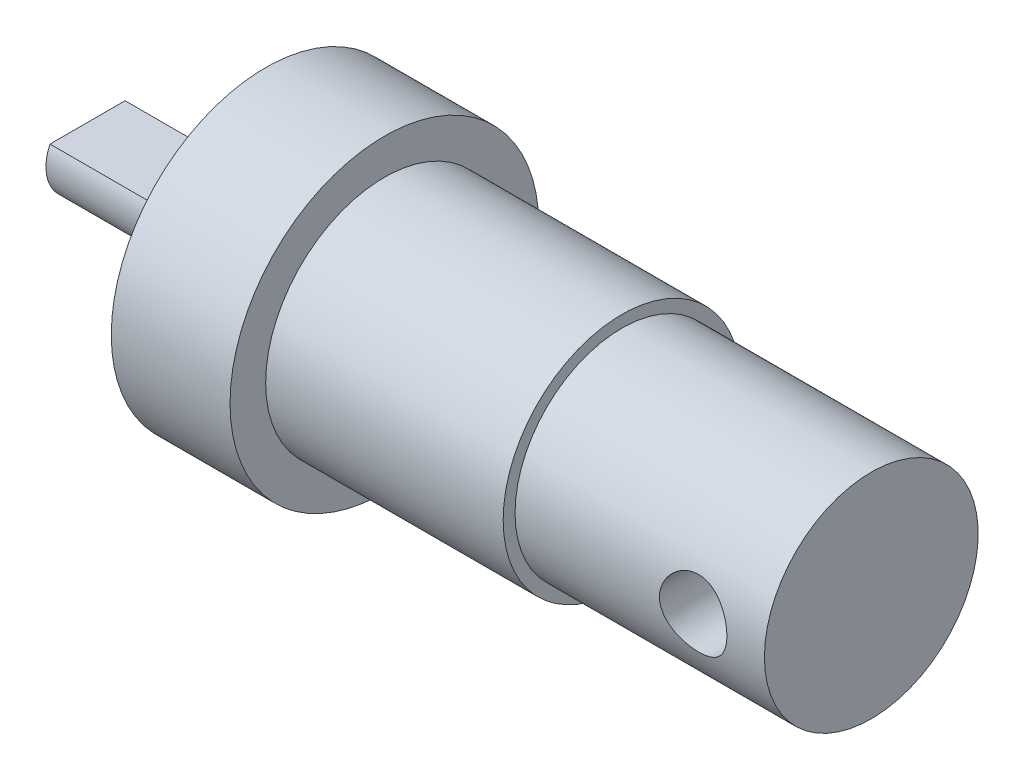
ISO-10303-21;
HEADER;
FILE_DESCRIPTION(('STEP AP214'),'2;1');
FILE_NAME('part.step','',(''),(''),'','','');
FILE_SCHEMA(('AUTOMOTIVE_DESIGN { 1 0 10303 214 1 1 1 1 }'));
ENDSEC;
DATA;
#1=APPLICATION_CONTEXT('core data for automotive mechanical design processes');
#2=APPLICATION_PROTOCOL_DEFINITION('international standard','automotive_design',2000,#1);
#3=PRODUCT_CONTEXT('',#1,'mechanical');
#4=PRODUCT('Part','Part','',(#3));
#5=PRODUCT_RELATED_PRODUCT_CATEGORY('part','',(#4));
#6=PRODUCT_DEFINITION_FORMATION('','',#4);
#7=PRODUCT_DEFINITION_CONTEXT('part definition',#1,'design');
#8=PRODUCT_DEFINITION('design','',#6,#7);
#9=PRODUCT_DEFINITION_SHAPE('','',#8);
#10=(LENGTH_UNIT() NAMED_UNIT(*) SI_UNIT(.MILLI.,.METRE.));
#11=(NAMED_UNIT(*) PLANE_ANGLE_UNIT() SI_UNIT($,.RADIAN.));
#12=(NAMED_UNIT(*) SI_UNIT($,.STERADIAN.) SOLID_ANGLE_UNIT());
#13=UNCERTAINTY_MEASURE_WITH_UNIT(LENGTH_MEASURE(1.E-05),#10,'distance_accuracy_value','');
#14=(GEOMETRIC_REPRESENTATION_CONTEXT(3) GLOBAL_UNCERTAINTY_ASSIGNED_CONTEXT((#13)) GLOBAL_UNIT_ASSIGNED_CONTEXT((#10,
#11,#12)) REPRESENTATION_CONTEXT('',''));
#15=CARTESIAN_POINT('',(0.,0.,0.));
#16=DIRECTION('',(0.,0.,1.));
#17=DIRECTION('',(1.,0.,0.));
#18=AXIS2_PLACEMENT_3D('',#15,#16,#17);
#19=CARTESIAN_POINT('',(-5.,0.,0.));
#20=DIRECTION('',(-1.,0.,0.));
#21=DIRECTION('',(0.,0.,1.));
#22=AXIS2_PLACEMENT_3D('',#19,#20,#21);
#23=CYLINDRICAL_SURFACE('',#22,4.5);
#24=CARTESIAN_POINT('',(16.588256828574,-1.09764286276754,4.36407838447224));
#25=CARTESIAN_POINT('',(16.5270833845499,-1.04617330759767,4.3770231438269));
#26=CARTESIAN_POINT('',(16.4702957225923,-0.989555024817385,4.39029354434856));
#27=CARTESIAN_POINT('',(16.3669482948807,-0.867467578833485,4.41603753323898));
#28=CARTESIAN_POINT('',(16.3203910086217,-0.801996276156327,4.42851092792226));
#29=CARTESIAN_POINT('',(16.2387721071905,-0.663768969664404,4.45132759737578));
#30=CARTESIAN_POINT('',(16.2037254457204,-0.591003648861528,4.46166809482042));
#31=CARTESIAN_POINT('',(16.1463734983666,-0.440249431524472,4.47905430840141));
#32=CARTESIAN_POINT('',(16.1240640621078,-0.362262245779606,4.48610109764383));
#33=CARTESIAN_POINT('',(16.0934520755528,-0.205622706533306,4.49596502276719));
#34=CARTESIAN_POINT('',(16.0847710562777,-0.127051613127193,4.49889619655373));
#35=CARTESIAN_POINT('',(16.08056352236,0.0304814895061291,4.50058568922495));
#36=CARTESIAN_POINT('',(16.0850348574784,0.109443432727423,4.49934469020088));
#37=CARTESIAN_POINT('',(16.106621519285,0.262909411636466,4.49294972792596));
#38=CARTESIAN_POINT('',(16.1233360822228,0.337475597910401,4.48791964963629));
#39=CARTESIAN_POINT('',(16.1683855120653,0.482700819526159,4.47463080465224));
#40=CARTESIAN_POINT('',(16.1967213843163,0.553359516235207,4.46637175862642));
#41=CARTESIAN_POINT('',(16.2647408305174,0.690176756413004,4.44730420264569));
#42=CARTESIAN_POINT('',(16.3046149506909,0.756234477154448,4.43645346687148));
#43=CARTESIAN_POINT('',(16.394395149402,0.880880079855516,4.41339714944489));
#44=CARTESIAN_POINT('',(16.4443038611503,0.939465994504709,4.4011912125469));
#45=CARTESIAN_POINT('',(16.5551388809534,1.0500078547806,4.37616597814393));
#46=CARTESIAN_POINT('',(16.6164312910696,1.10159632464824,4.36334195554905));
#47=CARTESIAN_POINT('',(16.7470058842268,1.19383246764867,4.33901442997745));
#48=CARTESIAN_POINT('',(16.8162884792733,1.234479576241,4.32751099515655));
#49=CARTESIAN_POINT('',(16.9613224490413,1.30374405651637,4.30715291598078));
#50=CARTESIAN_POINT('',(17.0370963466137,1.33231731944445,4.29830801730032));
#51=CARTESIAN_POINT('',(17.1927202408564,1.37620178670478,4.28446101595956));
#52=CARTESIAN_POINT('',(17.2725687020976,1.39151794823268,4.27945747698815));
#53=CARTESIAN_POINT('',(17.4303964139966,1.40793522697943,4.2740834338695));
#54=CARTESIAN_POINT('',(17.5083090176739,1.40961767642176,4.27352348052725));
#55=CARTESIAN_POINT('',(17.6632707119512,1.40023003273705,4.27660843959136));
#56=CARTESIAN_POINT('',(17.7403198817229,1.38916111865765,4.28025296323317));
#57=CARTESIAN_POINT('',(17.8897042210857,1.3550556783883,4.29116900724109));
#58=CARTESIAN_POINT('',(17.9621047143719,1.332277976861,4.29836195578642));
#59=CARTESIAN_POINT('',(18.1020808586957,1.27564264822176,4.31550767501424));
#60=CARTESIAN_POINT('',(18.1696555977164,1.24178293344075,4.32546096564581));
#61=CARTESIAN_POINT('',(18.3006113476724,1.16258163146239,4.34742970657724));
#62=CARTESIAN_POINT('',(18.3637667613169,1.11688372289622,4.35950452940484));
#63=CARTESIAN_POINT('',(18.4817081607143,1.01582716673405,4.38415284376729));
#64=CARTESIAN_POINT('',(18.5364921167669,0.960466183226663,4.39672645530803));
#65=CARTESIAN_POINT('',(18.6381589197758,0.839245617278976,4.42149568907948));
#66=CARTESIAN_POINT('',(18.6846828995163,0.773077955951485,4.43366103644533));
#67=CARTESIAN_POINT('',(18.7659336186728,0.633510958829209,4.45574319712107));
#68=CARTESIAN_POINT('',(18.8006617615522,0.560112484694877,4.46566027788202));
#69=CARTESIAN_POINT('',(18.856723172855,0.409325980989382,4.48197576080136));
#70=CARTESIAN_POINT('',(18.8782602159385,0.332019723059085,4.48842749224505));
#71=CARTESIAN_POINT('',(18.9080072619068,0.174666450378519,4.49729836197749));
#72=CARTESIAN_POINT('',(18.9162211751872,0.0946202468596981,4.4997186835079));
#73=CARTESIAN_POINT('',(18.9189677122617,-0.0624690592487289,4.50022444837237));
#74=CARTESIAN_POINT('',(18.9140400035918,-0.139502745729366,4.49848118168211));
#75=CARTESIAN_POINT('',(18.8918393346655,-0.291577914190268,4.49118897160743));
#76=CARTESIAN_POINT('',(18.8745665348833,-0.366619422053783,4.48564007769251));
#77=CARTESIAN_POINT('',(18.8283623435738,-0.512403733563475,4.47133029815602));
#78=CARTESIAN_POINT('',(18.7994700183276,-0.583160036425868,4.46258018424648));
#79=CARTESIAN_POINT('',(18.7309179231091,-0.718889807190914,4.44273655396938));
#80=CARTESIAN_POINT('',(18.6912558688062,-0.783862044368446,4.43164254055617));
#81=CARTESIAN_POINT('',(18.6004720769187,-0.90892482746428,4.40772841402676));
#82=CARTESIAN_POINT('',(18.5489615032798,-0.968723499325894,4.39485762762571));
#83=CARTESIAN_POINT('',(18.4367601561955,-1.078995404383,4.3690939522649));
#84=CARTESIAN_POINT('',(18.3760671902416,-1.1294664039697,4.35620105875541));
#85=CARTESIAN_POINT('',(18.2451941530672,-1.22100274011996,4.33145091084048));
#86=CARTESIAN_POINT('',(18.1748004678941,-1.26177398226855,4.31963149603054));
#87=CARTESIAN_POINT('',(18.0277261878037,-1.33079279652204,4.29887170933553));
#88=CARTESIAN_POINT('',(17.9510472930591,-1.35904374225341,4.28993056207168));
#89=CARTESIAN_POINT('',(17.7959681334656,-1.40134834975203,4.27629589201585));
#90=CARTESIAN_POINT('',(17.7176871590608,-1.41579980305004,4.27148378935246));
#91=CARTESIAN_POINT('',(17.5596727817714,-1.43136336966998,4.26629471944701));
#92=CARTESIAN_POINT('',(17.4799398077428,-1.43247935969269,4.26591646325925));
#93=CARTESIAN_POINT('',(17.3250789671269,-1.42158811888939,4.26955654197089));
#94=CARTESIAN_POINT('',(17.2499044229051,-1.41016452676373,4.27337935274072));
#95=CARTESIAN_POINT('',(17.1026141962774,-1.3755392767566,4.28464929525765));
#96=CARTESIAN_POINT('',(17.0304984441961,-1.35233788731417,4.2920963444011));
#97=CARTESIAN_POINT('',(16.893185222985,-1.29575485674209,4.30950850340981));
#98=CARTESIAN_POINT('',(16.827848431618,-1.26268519899504,4.31939503191314));
#99=CARTESIAN_POINT('',(16.7032152476673,-1.18704724766282,4.34079035515485));
#100=CARTESIAN_POINT('',(16.6439203841792,-1.1444765582031,4.35229955881305));
#101=CARTESIAN_POINT('',(16.588256828574,-1.09764286276754,4.36407838447224));
#102=B_SPLINE_CURVE_WITH_KNOTS('',3,(#24,#25,#26,#27,#28,#29,#30,#31,#32,#33,#34,#35,#36,#37,
#38,#39,#40,#41,#42,#43,#44,#45,#46,#47,#48,#49,#50,#51,#52,#53,#54,#55,#56,#57,#58,#59,#60,#61,
#62,#63,#64,#65,#66,#67,#68,#69,#70,#71,#72,#73,#74,#75,#76,#77,#78,#79,#80,#81,#82,#83,#84,#85,
#86,#87,#88,#89,#90,#91,#92,#93,#94,#95,#96,#97,#98,#99,#100,#101),.UNSPECIFIED.,.T.,.F.,(4,2,2,
2,2,2,2,2,2,2,2,2,2,2,2,2,2,2,2,2,2,2,2,2,2,2,2,2,2,2,2,2,2,2,2,2,2,2,4),(0.,0.242702533584567,
0.485463825285499,0.728539257342805,0.971535438950307,1.20765594384168,1.44373784824706,
1.67241894871094,1.90111983629102,2.13383711020089,2.36661553211963,2.60888006148042,
2.85115708854776,3.09431171777218,3.33737538545051,3.57001737109382,3.80263784735339,
4.0303242169466,4.25805350361953,4.49365186103091,4.72930725008102,4.97351432446402,
5.21769233300958,5.45799633849311,5.69822980095238,5.92875137489625,6.15926995233645,
6.38901989196278,6.61881860118457,6.85764091229053,7.0965203380096,7.3419153628579,
7.58724422511599,7.82526619955984,8.06321897787511,8.29054877700683,8.51787339508033,
8.73865998730796,8.95950231830971),.UNSPECIFIED.);
#103=CARTESIAN_POINT('',(16.588256828574,-1.09764286276754,4.36407838447224));
#104=VERTEX_POINT('',#103);
#105=EDGE_CURVE('E84',#104,#104,#102,.T.);
#106=ORIENTED_EDGE('',*,*,#105,.T.);
#107=EDGE_LOOP('',(#106));
#108=FACE_BOUND('',#107,.T.);
#109=CARTESIAN_POINT('',(20.5,0.,0.));
#110=DIRECTION('',(-1.,0.,0.));
#111=DIRECTION('',(0.,0.,1.));
#112=AXIS2_PLACEMENT_3D('',#109,#110,#111);
#113=CIRCLE('',#112,4.5);
#114=CARTESIAN_POINT('',(20.5,0.,4.5));
#115=VERTEX_POINT('',#114);
#116=EDGE_CURVE('E11',#115,#115,#113,.T.);
#117=ORIENTED_EDGE('',*,*,#116,.T.);
#118=EDGE_LOOP('',(#117));
#119=FACE_BOUND('',#118,.T.);
#120=CARTESIAN_POINT('',(10.,0.,0.));
#121=DIRECTION('',(-1.,0.,0.));
#122=DIRECTION('',(0.,0.,1.));
#123=AXIS2_PLACEMENT_3D('',#120,#121,#122);
#124=CIRCLE('',#123,4.5);
#125=CARTESIAN_POINT('',(10.,0.,4.5));
#126=VERTEX_POINT('',#125);
#127=EDGE_CURVE('E49',#126,#126,#124,.T.);
#128=ORIENTED_EDGE('',*,*,#127,.F.);
#129=EDGE_LOOP('',(#128));
#130=FACE_BOUND('',#129,.T.);
#131=CARTESIAN_POINT('',(16.5380390080738,-1.15000654639858,-4.350572944251));
#132=CARTESIAN_POINT('',(16.5988396562903,-1.20312781571059,-4.33653175760877));
#133=CARTESIAN_POINT('',(16.6640952030295,-1.25122898753903,-4.32277496877338));
#134=CARTESIAN_POINT('',(16.8019542248214,-1.33611907722739,-4.29729637605486));
#135=CARTESIAN_POINT('',(16.8745565958856,-1.37290969135075,-4.28557426714226));
#136=CARTESIAN_POINT('',(17.0254457658307,-1.43411761602508,-4.26548401430013));
#137=CARTESIAN_POINT('',(17.1037444915241,-1.45850805849832,-4.25712316150053));
#138=CARTESIAN_POINT('',(17.2636448639279,-1.49389201104003,-4.24483742560101));
#139=CARTESIAN_POINT('',(17.3452454438687,-1.504889812881,-4.24091112144587));
#140=CARTESIAN_POINT('',(17.5061580155133,-1.5128992881907,-4.23805987132111));
#141=CARTESIAN_POINT('',(17.5854419259637,-1.5104170501978,-4.23895394207542));
#142=CARTESIAN_POINT('',(17.7423913256221,-1.49273270034516,-4.24521316942359));
#143=CARTESIAN_POINT('',(17.8200568249584,-1.47753066811229,-4.25057829802828));
#144=CARTESIAN_POINT('',(17.9705787251869,-1.43525184769364,-4.26503667023593));
#145=CARTESIAN_POINT('',(18.0434851591471,-1.40833483547954,-4.27407964799084));
#146=CARTESIAN_POINT('',(18.1838111126746,-1.34350856820952,-4.2948968301067));
#147=CARTESIAN_POINT('',(18.2512293839887,-1.3055968213565,-4.30667165347971));
#148=CARTESIAN_POINT('',(18.3819328219342,-1.21785996866901,-4.33231956957801));
#149=CARTESIAN_POINT('',(18.4448963202271,-1.1675762364774,-4.34626315441587));
#150=CARTESIAN_POINT('',(18.5616929917308,-1.05737225430357,-4.37437926523118));
#151=CARTESIAN_POINT('',(18.6155238861328,-0.997449606420628,-4.3885518473857));
#152=CARTESIAN_POINT('',(18.7144059317459,-0.867132969146684,-4.41618190885194));
#153=CARTESIAN_POINT('',(18.7590843676215,-0.796446147571748,-4.42959706868594));
#154=CARTESIAN_POINT('',(18.8358342541774,-0.648102478297907,-4.45371758702122));
#155=CARTESIAN_POINT('',(18.8679081156449,-0.570446966944213,-4.46442346356825));
#156=CARTESIAN_POINT('',(18.9176848506066,-0.41235647336254,-4.48175457862457));
#157=CARTESIAN_POINT('',(18.9357244910769,-0.332038231612042,-4.48847445829572));
#158=CARTESIAN_POINT('',(18.9580230373535,-0.169277461005923,-4.49755261610232));
#159=CARTESIAN_POINT('',(18.9622861390937,-0.0868355866595316,-4.49991222215685));
#160=CARTESIAN_POINT('',(18.9569743587064,0.073997450723559,-4.50007929710386));
#161=CARTESIAN_POINT('',(18.947993386838,0.152408813312954,-4.49808032700807));
#162=CARTESIAN_POINT('',(18.917586524,0.30657121563003,-4.49020857208875));
#163=CARTESIAN_POINT('',(18.8961605032106,0.382322227597664,-4.48433574685522));
#164=CARTESIAN_POINT('',(18.8415549815971,0.529201310223197,-4.46938553869545));
#165=CARTESIAN_POINT('',(18.8083627689288,0.600324282135094,-4.46030468995239));
#166=CARTESIAN_POINT('',(18.7312193975721,0.736123139693359,-4.43991487432775));
#167=CARTESIAN_POINT('',(18.6872657367632,0.80079752106386,-4.4286053893904));
#168=CARTESIAN_POINT('',(18.5876671850072,0.924796802829211,-4.40441965514291));
#169=CARTESIAN_POINT('',(18.5316048944265,0.983777649900602,-4.39149725267683));
#170=CARTESIAN_POINT('',(18.4104418825284,1.09167729862862,-4.36592741212696));
#171=CARTESIAN_POINT('',(18.3453392447065,1.14059396126186,-4.3532800330059));
#172=CARTESIAN_POINT('',(18.2060162264319,1.228105572802,-4.32941908656565));
#173=CARTESIAN_POINT('',(18.1316140097056,1.26642354592331,-4.31824738940904));
#174=CARTESIAN_POINT('',(17.9770046358206,1.3298902435334,-4.2991277744522));
#175=CARTESIAN_POINT('',(17.8967992507862,1.35504296916069,-4.29117887735494));
#176=CARTESIAN_POINT('',(17.7356551190021,1.39065011863879,-4.27977028921809));
#177=CARTESIAN_POINT('',(17.654827266842,1.40156078662261,-4.27617153902094));
#178=CARTESIAN_POINT('',(17.4924178855048,1.40976206646939,-4.27347546037303));
#179=CARTESIAN_POINT('',(17.4108365436152,1.40705597656324,-4.2743770418582));
#180=CARTESIAN_POINT('',(17.2525332934141,1.3885067958519,-4.28043619050029));
#181=CARTESIAN_POINT('',(17.1757448550602,1.37317000653626,-4.28542969509521));
#182=CARTESIAN_POINT('',(17.0258769874089,1.33055461898547,-4.29885088981683));
#183=CARTESIAN_POINT('',(16.9527980392354,1.30327447608166,-4.30727902414443));
#184=CARTESIAN_POINT('',(16.8108203309642,1.2369873084396,-4.32678550364665));
#185=CARTESIAN_POINT('',(16.7420289901806,1.19776484815543,-4.33791169911247));
#186=CARTESIAN_POINT('',(16.6118068312919,1.10887583791017,-4.36147958669007));
#187=CARTESIAN_POINT('',(16.5503780069981,1.05920646885388,-4.37392163343242));
#188=CARTESIAN_POINT('',(16.4336885793645,0.948141141062849,-4.39936517710429));
#189=CARTESIAN_POINT('',(16.3788385156505,0.886312792612338,-4.4123662382327));
#190=CARTESIAN_POINT('',(16.2802080542319,0.75410534768408,-4.43687261745295));
#191=CARTESIAN_POINT('',(16.2364279967761,0.68372598847998,-4.44837788956479));
#192=CARTESIAN_POINT('',(16.1611971574693,0.53611304837285,-4.46857185324819));
#193=CARTESIAN_POINT('',(16.1297674671199,0.458868015928004,-4.47725572219055));
#194=CARTESIAN_POINT('',(16.0804606209595,0.299847867721547,-4.49070671177476));
#195=CARTESIAN_POINT('',(16.0625789132605,0.218074283392906,-4.49547514797947));
#196=CARTESIAN_POINT('',(16.0415124808396,0.0561007883647794,-4.50034835120317));
#197=CARTESIAN_POINT('',(16.0377294032548,-0.0240158206556514,-4.50064466004347));
#198=CARTESIAN_POINT('',(16.0433268327284,-0.183679511531178,-4.49695850133299));
#199=CARTESIAN_POINT('',(16.0527055404023,-0.263226669743229,-4.49297661868323));
#200=CARTESIAN_POINT('',(16.0839080825948,-0.417719155721959,-4.48122615255189));
#201=CARTESIAN_POINT('',(16.1054566959177,-0.49272695166344,-4.47354184521748));
#202=CARTESIAN_POINT('',(16.160064067598,-0.638031452975403,-4.45514145264556));
#203=CARTESIAN_POINT('',(16.1931254366125,-0.708327085490511,-4.44442467986311));
#204=CARTESIAN_POINT('',(16.2717645306896,-0.845985205692363,-4.42034411866261));
#205=CARTESIAN_POINT('',(16.3178984490477,-0.913010989238563,-4.40687255313094));
#206=CARTESIAN_POINT('',(16.4205386738743,-1.03837859992938,-4.3790297156002));
#207=CARTESIAN_POINT('',(16.4770473762564,-1.09671841552177,-4.36465823628463));
#208=CARTESIAN_POINT('',(16.5380390080738,-1.15000654639858,-4.350572944251));
#209=B_SPLINE_CURVE_WITH_KNOTS('',3,(#131,#132,#133,#134,#135,#136,#137,#138,#139,#140,#141,
#142,#143,#144,#145,#146,#147,#148,#149,#150,#151,#152,#153,#154,#155,#156,#157,#158,#159,#160,
#161,#162,#163,#164,#165,#166,#167,#168,#169,#170,#171,#172,#173,#174,#175,#176,#177,#178,#179,
#180,#181,#182,#183,#184,#185,#186,#187,#188,#189,#190,#191,#192,#193,#194,#195,#196,#197,#198,
#199,#200,#201,#202,#203,#204,#205,#206,#207,#208),.UNSPECIFIED.,.T.,.F.,(4,2,2,2,2,2,2,2,2,2,2,
2,2,2,2,2,2,2,2,2,2,2,2,2,2,2,2,2,2,2,2,2,2,2,2,2,2,2,4),(0.,0.245572905237851,
0.491108963506395,0.73717479368322,0.983161749444172,1.21997886451829,1.45679449711065,
1.69047682558643,1.92421215621509,2.16844624151571,2.41274117986602,2.66557634417378,
2.91836312693611,3.16487895434109,3.41131969309778,3.64703980561415,3.88276237707628,
4.11874039626769,4.35477333437697,4.60083511054641,4.84694913033403,5.0989908330661,
5.35095589157437,5.59463331704048,5.83825172216388,6.07255442481337,6.30688743946924,
6.54572702060687,6.78463113541378,7.03446043477486,7.2842974119823,7.53455921634114,
7.78473689972675,8.02416747701856,8.2635653242725,8.49775435043548,8.73199651642045,
8.97828385317594,9.22462813831062),.UNSPECIFIED.);
#210=CARTESIAN_POINT('',(16.5380390080738,-1.15000654639858,-4.350572944251));
#211=VERTEX_POINT('',#210);
#212=EDGE_CURVE('E39',#211,#211,#209,.T.);
#213=ORIENTED_EDGE('',*,*,#212,.T.);
#214=EDGE_LOOP('',(#213));
#215=FACE_BOUND('',#214,.T.);
#216=ADVANCED_FACE('F35',(#108,#119,#130,#215),#23,.T.);
#217=CARTESIAN_POINT('',(-5.,0.,0.));
#218=DIRECTION('',(1.,0.,0.));
#219=DIRECTION('',(0.,0.,-1.));
#220=AXIS2_PLACEMENT_3D('',#217,#218,#219);
#221=PLANE('',#220);
#222=DIRECTION('',(0.,0.,-1.));
#223=VECTOR('',#222,1.);
#224=CARTESIAN_POINT('',(-5.,0.75,0.));
#225=LINE('',#224,#223);
#226=CARTESIAN_POINT('',(-5.,0.75,1.58113883008419));
#227=VERTEX_POINT('',#226);
#228=CARTESIAN_POINT('',(-5.,0.75,-1.58113883008419));
#229=VERTEX_POINT('',#228);
#230=EDGE_CURVE('E69',#227,#229,#225,.T.);
#231=ORIENTED_EDGE('',*,*,#230,.F.);
#232=CARTESIAN_POINT('',(-5.,0.,0.));
#233=DIRECTION('',(-1.,0.,0.));
#234=DIRECTION('',(0.,0.,1.));
#235=AXIS2_PLACEMENT_3D('',#232,#233,#234);
#236=CIRCLE('',#235,1.75);
#237=EDGE_CURVE('E56',#229,#227,#236,.T.);
#238=ORIENTED_EDGE('',*,*,#237,.F.);
#239=EDGE_LOOP('',(#231,#238));
#240=FACE_BOUND('',#239,.T.);
#241=CARTESIAN_POINT('',(-5.,0.,0.));
#242=DIRECTION('',(-1.,0.,0.));
#243=DIRECTION('',(0.,0.,1.));
#244=AXIS2_PLACEMENT_3D('',#241,#242,#243);
#245=CIRCLE('',#244,6.5);
#246=CARTESIAN_POINT('',(-5.,0.,6.5));
#247=VERTEX_POINT('',#246);
#248=EDGE_CURVE('E88',#247,#247,#245,.T.);
#249=ORIENTED_EDGE('',*,*,#248,.T.);
#250=EDGE_LOOP('',(#249));
#251=FACE_BOUND('',#250,.T.);
#252=ADVANCED_FACE('F37',(#240,#251),#221,.F.);
#253=CARTESIAN_POINT('',(20.5,0.,0.));
#254=DIRECTION('',(-1.,0.,0.));
#255=DIRECTION('',(0.,0.,1.));
#256=AXIS2_PLACEMENT_3D('',#253,#254,#255);
#257=PLANE('',#256);
#258=ORIENTED_EDGE('',*,*,#116,.F.);
#259=EDGE_LOOP('',(#258));
#260=FACE_BOUND('',#259,.T.);
#261=ADVANCED_FACE('F128',(#260),#257,.F.);
#262=CARTESIAN_POINT('',(10.,0.,0.));
#263=DIRECTION('',(1.,0.,0.));
#264=DIRECTION('',(0.,0.,-1.));
#265=AXIS2_PLACEMENT_3D('',#262,#263,#264);
#266=PLANE('',#265);
#267=ORIENTED_EDGE('',*,*,#127,.T.);
#268=EDGE_LOOP('',(#267));
#269=FACE_BOUND('',#268,.T.);
#270=CARTESIAN_POINT('',(10.,0.,0.));
#271=DIRECTION('',(-1.,0.,0.));
#272=DIRECTION('',(0.,0.,1.));
#273=AXIS2_PLACEMENT_3D('',#270,#271,#272);
#274=CIRCLE('',#273,5.);
#275=CARTESIAN_POINT('',(10.,0.,5.));
#276=VERTEX_POINT('',#275);
#277=EDGE_CURVE('E97',#276,#276,#274,.T.);
#278=ORIENTED_EDGE('',*,*,#277,.F.);
#279=EDGE_LOOP('',(#278));
#280=FACE_BOUND('',#279,.T.);
#281=ADVANCED_FACE('F125',(#269,#280),#266,.T.);
#282=CARTESIAN_POINT('',(-5.,0.,0.));
#283=DIRECTION('',(-1.,0.,0.));
#284=DIRECTION('',(0.,0.,1.));
#285=AXIS2_PLACEMENT_3D('',#282,#283,#284);
#286=CYLINDRICAL_SURFACE('',#285,5.);
#287=CARTESIAN_POINT('',(0.,0.,0.));
#288=DIRECTION('',(-1.,0.,0.));
#289=DIRECTION('',(0.,0.,1.));
#290=AXIS2_PLACEMENT_3D('',#287,#288,#289);
#291=CIRCLE('',#290,5.);
#292=CARTESIAN_POINT('',(0.,0.,5.));
#293=VERTEX_POINT('',#292);
#294=EDGE_CURVE('E94',#293,#293,#291,.T.);
#295=ORIENTED_EDGE('',*,*,#294,.F.);
#296=EDGE_LOOP('',(#295));
#297=FACE_BOUND('',#296,.T.);
#298=ORIENTED_EDGE('',*,*,#277,.T.);
#299=EDGE_LOOP('',(#298));
#300=FACE_BOUND('',#299,.T.);
#301=ADVANCED_FACE('F122',(#297,#300),#286,.T.);
#302=CARTESIAN_POINT('',(0.,0.,0.));
#303=DIRECTION('',(-1.,0.,0.));
#304=DIRECTION('',(0.,0.,1.));
#305=AXIS2_PLACEMENT_3D('',#302,#303,#304);
#306=PLANE('',#305);
#307=CARTESIAN_POINT('',(0.,0.,0.));
#308=DIRECTION('',(-1.,0.,0.));
#309=DIRECTION('',(0.,0.,1.));
#310=AXIS2_PLACEMENT_3D('',#307,#308,#309);
#311=CIRCLE('',#310,6.5);
#312=CARTESIAN_POINT('',(0.,0.,6.5));
#313=VERTEX_POINT('',#312);
#314=EDGE_CURVE('E91',#313,#313,#311,.T.);
#315=ORIENTED_EDGE('',*,*,#314,.F.);
#316=EDGE_LOOP('',(#315));
#317=FACE_BOUND('',#316,.T.);
#318=ORIENTED_EDGE('',*,*,#294,.T.);
#319=EDGE_LOOP('',(#318));
#320=FACE_BOUND('',#319,.T.);
#321=ADVANCED_FACE('F118',(#317,#320),#306,.F.);
#322=CARTESIAN_POINT('',(-5.,0.,0.));
#323=DIRECTION('',(-1.,0.,0.));
#324=DIRECTION('',(0.,0.,1.));
#325=AXIS2_PLACEMENT_3D('',#322,#323,#324);
#326=CYLINDRICAL_SURFACE('',#325,6.5);
#327=ORIENTED_EDGE('',*,*,#248,.F.);
#328=EDGE_LOOP('',(#327));
#329=FACE_BOUND('',#328,.T.);
#330=ORIENTED_EDGE('',*,*,#314,.T.);
#331=EDGE_LOOP('',(#330));
#332=FACE_BOUND('',#331,.T.);
#333=ADVANCED_FACE('F112',(#329,#332),#326,.T.);
#334=CARTESIAN_POINT('',(17.5,-0.0674472883090074,-7.59299035054011));
#335=DIRECTION('',(0.,-0.0047252868789963,-0.999988835769636));
#336=DIRECTION('',(0.,0.999988835769636,-0.0047252868789963));
#337=AXIS2_PLACEMENT_3D('',#334,#335,#336);
#338=CONICAL_SURFACE('',#337,1.47498353276021,0.00472530446380527);
#339=ORIENTED_EDGE('',*,*,#212,.F.);
#340=EDGE_LOOP('',(#339));
#341=FACE_BOUND('',#340,.T.);
#342=ORIENTED_EDGE('',*,*,#105,.F.);
#343=EDGE_LOOP('',(#342));
#344=FACE_BOUND('',#343,.T.);
#345=ADVANCED_FACE('F107',(#341,#344),#338,.F.);
#346=CARTESIAN_POINT('',(-12.5,0.75,0.));
#347=DIRECTION('',(0.,-1.,0.));
#348=DIRECTION('',(0.,0.,-1.));
#349=AXIS2_PLACEMENT_3D('',#346,#347,#348);
#350=PLANE('',#349);
#351=ORIENTED_EDGE('',*,*,#230,.T.);
#352=DIRECTION('',(1.,0.,0.));
#353=VECTOR('',#352,1.);
#354=CARTESIAN_POINT('',(-12.5,0.75,-1.58113883008419));
#355=LINE('',#354,#353);
#356=CARTESIAN_POINT('',(-12.5,0.75,-1.58113883008419));
#357=VERTEX_POINT('',#356);
#358=EDGE_CURVE('E79',#357,#229,#355,.T.);
#359=ORIENTED_EDGE('',*,*,#358,.F.);
#360=DIRECTION('',(0.,0.,-1.));
#361=VECTOR('',#360,1.);
#362=CARTESIAN_POINT('',(-12.5,0.75,0.));
#363=LINE('',#362,#361);
#364=CARTESIAN_POINT('',(-12.5,0.75,1.58113883008419));
#365=VERTEX_POINT('',#364);
#366=EDGE_CURVE('E80',#365,#357,#363,.T.);
#367=ORIENTED_EDGE('',*,*,#366,.F.);
#368=DIRECTION('',(1.,0.,0.));
#369=VECTOR('',#368,1.);
#370=CARTESIAN_POINT('',(-12.5,0.75,1.58113883008419));
#371=LINE('',#370,#369);
#372=EDGE_CURVE('E77',#365,#227,#371,.T.);
#373=ORIENTED_EDGE('',*,*,#372,.T.);
#374=EDGE_LOOP('',(#351,#359,#367,#373));
#375=FACE_BOUND('',#374,.T.);
#376=ADVANCED_FACE('F82',(#375),#350,.F.);
#377=CARTESIAN_POINT('',(-12.5,0.,0.));
#378=DIRECTION('',(1.,0.,0.));
#379=DIRECTION('',(0.,0.,-1.));
#380=AXIS2_PLACEMENT_3D('',#377,#378,#379);
#381=CYLINDRICAL_SURFACE('',#380,1.75);
#382=ORIENTED_EDGE('',*,*,#237,.T.);
#383=ORIENTED_EDGE('',*,*,#372,.F.);
#384=CARTESIAN_POINT('',(-12.5,0.,0.));
#385=DIRECTION('',(-1.,0.,0.));
#386=DIRECTION('',(0.,0.,1.));
#387=AXIS2_PLACEMENT_3D('',#384,#385,#386);
#388=CIRCLE('',#387,1.75);
#389=EDGE_CURVE('E64',#357,#365,#388,.T.);
#390=ORIENTED_EDGE('',*,*,#389,.F.);
#391=ORIENTED_EDGE('',*,*,#358,.T.);
#392=EDGE_LOOP('',(#382,#383,#390,#391));
#393=FACE_BOUND('',#392,.T.);
#394=ADVANCED_FACE('F76',(#393),#381,.T.);
#395=CARTESIAN_POINT('',(-12.5,0.,0.));
#396=DIRECTION('',(-1.,0.,0.));
#397=DIRECTION('',(0.,0.,1.));
#398=AXIS2_PLACEMENT_3D('',#395,#396,#397);
#399=PLANE('',#398);
#400=ORIENTED_EDGE('',*,*,#366,.T.);
#401=ORIENTED_EDGE('',*,*,#389,.T.);
#402=EDGE_LOOP('',(#400,#401));
#403=FACE_BOUND('',#402,.T.);
#404=ADVANCED_FACE('F202',(#403),#399,.T.);
#405=CLOSED_SHELL('',(#216,#252,#261,#281,#301,#321,#333,#345,#376,#394,#404));
#406=MANIFOLD_SOLID_BREP('B2',#405);
#407=ADVANCED_BREP_SHAPE_REPRESENTATION('',(#18,#406),#14);
#408=SHAPE_DEFINITION_REPRESENTATION(#9,#407);
ENDSEC;
END-ISO-10303-21;
